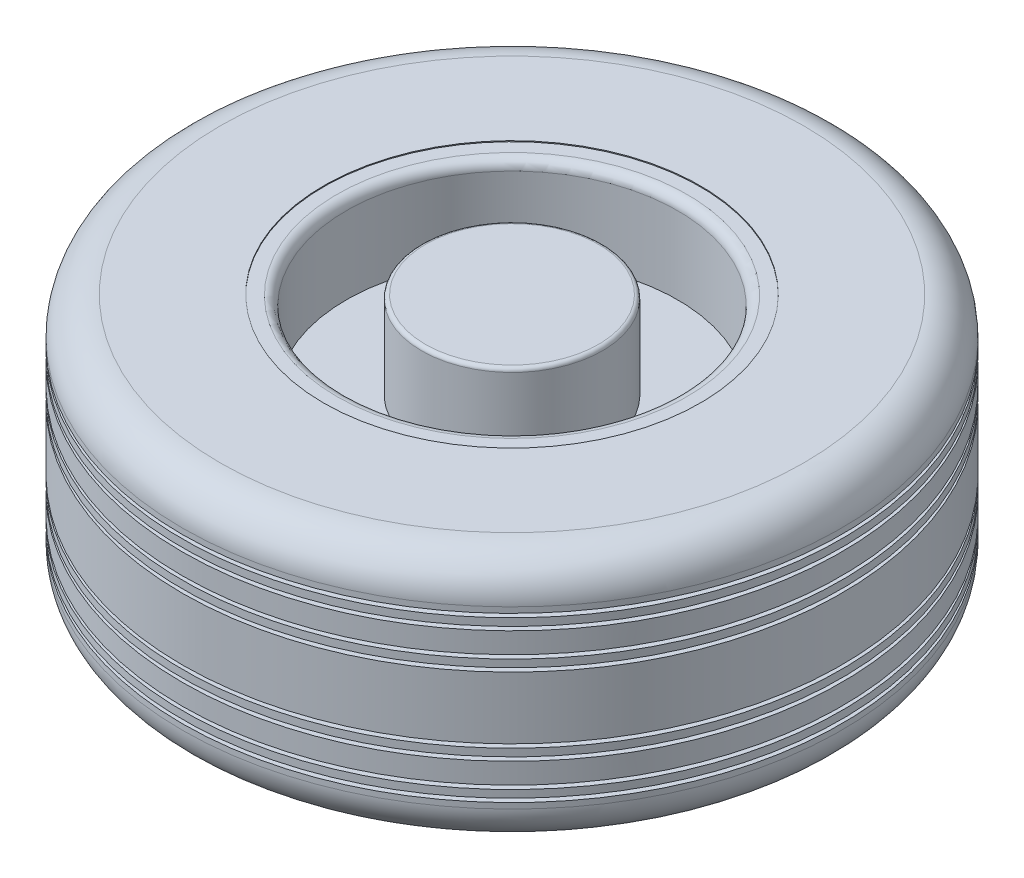
ISO-10303-21;
HEADER;
FILE_DESCRIPTION(('STEP AP214'),'2;1');
FILE_NAME('part.step','',(''),(''),'','','');
FILE_SCHEMA(('AUTOMOTIVE_DESIGN { 1 0 10303 214 1 1 1 1 }'));
ENDSEC;
DATA;
#1=APPLICATION_CONTEXT('core data for automotive mechanical design processes');
#2=APPLICATION_PROTOCOL_DEFINITION('international standard','automotive_design',2000,#1);
#3=PRODUCT_CONTEXT('',#1,'mechanical');
#4=PRODUCT('Part','Part','',(#3));
#5=PRODUCT_RELATED_PRODUCT_CATEGORY('part','',(#4));
#6=PRODUCT_DEFINITION_FORMATION('','',#4);
#7=PRODUCT_DEFINITION_CONTEXT('part definition',#1,'design');
#8=PRODUCT_DEFINITION('design','',#6,#7);
#9=PRODUCT_DEFINITION_SHAPE('','',#8);
#10=(LENGTH_UNIT() NAMED_UNIT(*) SI_UNIT(.MILLI.,.METRE.));
#11=(NAMED_UNIT(*) PLANE_ANGLE_UNIT() SI_UNIT($,.RADIAN.));
#12=(NAMED_UNIT(*) SI_UNIT($,.STERADIAN.) SOLID_ANGLE_UNIT());
#13=UNCERTAINTY_MEASURE_WITH_UNIT(LENGTH_MEASURE(1.E-05),#10,'distance_accuracy_value','');
#14=(GEOMETRIC_REPRESENTATION_CONTEXT(3) GLOBAL_UNCERTAINTY_ASSIGNED_CONTEXT((#13)) GLOBAL_UNIT_ASSIGNED_CONTEXT((#10,
#11,#12)) REPRESENTATION_CONTEXT('',''));
#15=CARTESIAN_POINT('',(0.,0.,0.));
#16=DIRECTION('',(0.,0.,1.));
#17=DIRECTION('',(1.,0.,0.));
#18=AXIS2_PLACEMENT_3D('',#15,#16,#17);
#19=CARTESIAN_POINT('',(0.,-47.6249999999999,0.));
#20=DIRECTION('',(0.,1.,0.));
#21=DIRECTION('',(0.,0.,1.));
#22=AXIS2_PLACEMENT_3D('',#19,#20,#21);
#23=PLANE('',#22);
#24=CARTESIAN_POINT('',(0.,-47.6249999999999,0.));
#25=DIRECTION('',(0.,-1.,0.));
#26=DIRECTION('',(0.,0.,-1.));
#27=AXIS2_PLACEMENT_3D('',#24,#25,#26);
#28=CIRCLE('',#27,210.82);
#29=CARTESIAN_POINT('',(0.,-47.6249999999999,-210.82));
#30=VERTEX_POINT('',#29);
#31=EDGE_CURVE('E81',#30,#30,#28,.T.);
#32=ORIENTED_EDGE('',*,*,#31,.T.);
#33=EDGE_LOOP('',(#32));
#34=FACE_BOUND('',#33,.T.);
#35=CARTESIAN_POINT('',(0.,-47.6249999999999,0.));
#36=DIRECTION('',(0.,-1.,0.));
#37=DIRECTION('',(0.,0.,-1.));
#38=AXIS2_PLACEMENT_3D('',#35,#36,#37);
#39=CIRCLE('',#38,222.25);
#40=CARTESIAN_POINT('',(0.,-47.6249999999999,-222.25));
#41=VERTEX_POINT('',#40);
#42=EDGE_CURVE('E12',#41,#41,#39,.T.);
#43=ORIENTED_EDGE('',*,*,#42,.F.);
#44=EDGE_LOOP('',(#43));
#45=FACE_BOUND('',#44,.T.);
#46=ADVANCED_FACE('F66',(#34,#45),#23,.T.);
#47=CARTESIAN_POINT('',(0.,0.,0.));
#48=DIRECTION('',(0.,-1.,0.));
#49=DIRECTION('',(0.,0.,-1.));
#50=AXIS2_PLACEMENT_3D('',#47,#48,#49);
#51=CYLINDRICAL_SURFACE('',#50,210.82);
#52=CARTESIAN_POINT('',(0.,-52.7049999999999,0.));
#53=DIRECTION('',(0.,-1.,0.));
#54=DIRECTION('',(0.,0.,-1.));
#55=AXIS2_PLACEMENT_3D('',#52,#53,#54);
#56=CIRCLE('',#55,210.82);
#57=CARTESIAN_POINT('',(0.,-52.7049999999999,-210.82));
#58=VERTEX_POINT('',#57);
#59=EDGE_CURVE('E77',#58,#58,#56,.T.);
#60=ORIENTED_EDGE('',*,*,#59,.T.);
#61=EDGE_LOOP('',(#60));
#62=FACE_BOUND('',#61,.T.);
#63=ORIENTED_EDGE('',*,*,#31,.F.);
#64=EDGE_LOOP('',(#63));
#65=FACE_BOUND('',#64,.T.);
#66=ADVANCED_FACE('F89',(#62,#65),#51,.F.);
#67=CARTESIAN_POINT('',(0.,-52.7049999999999,0.));
#68=DIRECTION('',(0.,-1.,0.));
#69=DIRECTION('',(0.,0.,-1.));
#70=AXIS2_PLACEMENT_3D('',#67,#68,#69);
#71=PLANE('',#70);
#72=CARTESIAN_POINT('',(0.,-52.7049999999999,0.));
#73=DIRECTION('',(0.,-1.,0.));
#74=DIRECTION('',(0.,0.,-1.));
#75=AXIS2_PLACEMENT_3D('',#72,#73,#74);
#76=CIRCLE('',#75,222.25);
#77=CARTESIAN_POINT('',(0.,-52.7049999999999,-222.25));
#78=VERTEX_POINT('',#77);
#79=EDGE_CURVE('E73',#78,#78,#76,.T.);
#80=ORIENTED_EDGE('',*,*,#79,.T.);
#81=EDGE_LOOP('',(#80));
#82=FACE_BOUND('',#81,.T.);
#83=ORIENTED_EDGE('',*,*,#59,.F.);
#84=EDGE_LOOP('',(#83));
#85=FACE_BOUND('',#84,.T.);
#86=ADVANCED_FACE('F91',(#82,#85),#71,.T.);
#87=CARTESIAN_POINT('',(0.,-84.455,0.));
#88=DIRECTION('',(0.,1.,0.));
#89=DIRECTION('',(0.,0.,1.));
#90=AXIS2_PLACEMENT_3D('',#87,#88,#89);
#91=CYLINDRICAL_SURFACE('',#90,222.25);
#92=ORIENTED_EDGE('',*,*,#79,.F.);
#93=EDGE_LOOP('',(#92));
#94=FACE_BOUND('',#93,.T.);
#95=ORIENTED_EDGE('',*,*,#42,.T.);
#96=EDGE_LOOP('',(#95));
#97=FACE_BOUND('',#96,.T.);
#98=ADVANCED_FACE('F68',(#94,#97),#91,.T.);
#99=CLOSED_SHELL('',(#46,#66,#86,#98));
#100=MANIFOLD_SOLID_BREP('B2',#99);
#101=CARTESIAN_POINT('',(0.,-23.4949999999999,0.));
#102=DIRECTION('',(0.,1.,0.));
#103=DIRECTION('',(0.,0.,1.));
#104=AXIS2_PLACEMENT_3D('',#101,#102,#103);
#105=PLANE('',#104);
#106=CARTESIAN_POINT('',(0.,-23.4949999999999,0.));
#107=DIRECTION('',(0.,-1.,0.));
#108=DIRECTION('',(0.,0.,-1.));
#109=AXIS2_PLACEMENT_3D('',#106,#107,#108);
#110=CIRCLE('',#109,210.82);
#111=CARTESIAN_POINT('',(0.,-23.4949999999999,-210.82));
#112=VERTEX_POINT('',#111);
#113=EDGE_CURVE('E155',#112,#112,#110,.T.);
#114=ORIENTED_EDGE('',*,*,#113,.T.);
#115=EDGE_LOOP('',(#114));
#116=FACE_BOUND('',#115,.T.);
#117=CARTESIAN_POINT('',(0.,-23.4949999999999,0.));
#118=DIRECTION('',(0.,-1.,0.));
#119=DIRECTION('',(0.,0.,-1.));
#120=AXIS2_PLACEMENT_3D('',#117,#118,#119);
#121=CIRCLE('',#120,222.25);
#122=CARTESIAN_POINT('',(0.,-23.4949999999999,-222.25));
#123=VERTEX_POINT('',#122);
#124=EDGE_CURVE('E65',#123,#123,#121,.T.);
#125=ORIENTED_EDGE('',*,*,#124,.F.);
#126=EDGE_LOOP('',(#125));
#127=FACE_BOUND('',#126,.T.);
#128=ADVANCED_FACE('F140',(#116,#127),#105,.T.);
#129=CARTESIAN_POINT('',(0.,0.,0.));
#130=DIRECTION('',(0.,-1.,0.));
#131=DIRECTION('',(0.,0.,-1.));
#132=AXIS2_PLACEMENT_3D('',#129,#130,#131);
#133=CYLINDRICAL_SURFACE('',#132,210.82);
#134=CARTESIAN_POINT('',(0.,-28.5749999999999,0.));
#135=DIRECTION('',(0.,-1.,0.));
#136=DIRECTION('',(0.,0.,-1.));
#137=AXIS2_PLACEMENT_3D('',#134,#135,#136);
#138=CIRCLE('',#137,210.82);
#139=CARTESIAN_POINT('',(0.,-28.5749999999999,-210.82));
#140=VERTEX_POINT('',#139);
#141=EDGE_CURVE('E151',#140,#140,#138,.T.);
#142=ORIENTED_EDGE('',*,*,#141,.T.);
#143=EDGE_LOOP('',(#142));
#144=FACE_BOUND('',#143,.T.);
#145=ORIENTED_EDGE('',*,*,#113,.F.);
#146=EDGE_LOOP('',(#145));
#147=FACE_BOUND('',#146,.T.);
#148=ADVANCED_FACE('F163',(#144,#147),#133,.F.);
#149=CARTESIAN_POINT('',(0.,-28.5749999999999,0.));
#150=DIRECTION('',(0.,-1.,0.));
#151=DIRECTION('',(0.,0.,-1.));
#152=AXIS2_PLACEMENT_3D('',#149,#150,#151);
#153=PLANE('',#152);
#154=CARTESIAN_POINT('',(0.,-28.5749999999999,0.));
#155=DIRECTION('',(0.,-1.,0.));
#156=DIRECTION('',(0.,0.,-1.));
#157=AXIS2_PLACEMENT_3D('',#154,#155,#156);
#158=CIRCLE('',#157,222.25);
#159=CARTESIAN_POINT('',(0.,-28.5749999999999,-222.25));
#160=VERTEX_POINT('',#159);
#161=EDGE_CURVE('E147',#160,#160,#158,.T.);
#162=ORIENTED_EDGE('',*,*,#161,.T.);
#163=EDGE_LOOP('',(#162));
#164=FACE_BOUND('',#163,.T.);
#165=ORIENTED_EDGE('',*,*,#141,.F.);
#166=EDGE_LOOP('',(#165));
#167=FACE_BOUND('',#166,.T.);
#168=ADVANCED_FACE('F165',(#164,#167),#153,.T.);
#169=CARTESIAN_POINT('',(0.,-84.455,0.));
#170=DIRECTION('',(0.,1.,0.));
#171=DIRECTION('',(0.,0.,1.));
#172=AXIS2_PLACEMENT_3D('',#169,#170,#171);
#173=CYLINDRICAL_SURFACE('',#172,222.25);
#174=ORIENTED_EDGE('',*,*,#161,.F.);
#175=EDGE_LOOP('',(#174));
#176=FACE_BOUND('',#175,.T.);
#177=ORIENTED_EDGE('',*,*,#124,.T.);
#178=EDGE_LOOP('',(#177));
#179=FACE_BOUND('',#178,.T.);
#180=ADVANCED_FACE('F142',(#176,#179),#173,.T.);
#181=CLOSED_SHELL('',(#128,#148,#168,#180));
#182=MANIFOLD_SOLID_BREP('B7',#181);
#183=CARTESIAN_POINT('',(0.,23.4949999999999,0.));
#184=DIRECTION('',(0.,1.,0.));
#185=DIRECTION('',(0.,0.,1.));
#186=AXIS2_PLACEMENT_3D('',#183,#184,#185);
#187=PLANE('',#186);
#188=CARTESIAN_POINT('',(0.,23.4949999999999,0.));
#189=DIRECTION('',(0.,-1.,0.));
#190=DIRECTION('',(0.,0.,-1.));
#191=AXIS2_PLACEMENT_3D('',#188,#189,#190);
#192=CIRCLE('',#191,210.82);
#193=CARTESIAN_POINT('',(0.,23.4949999999999,-210.82));
#194=VERTEX_POINT('',#193);
#195=EDGE_CURVE('E225',#194,#194,#192,.T.);
#196=ORIENTED_EDGE('',*,*,#195,.F.);
#197=EDGE_LOOP('',(#196));
#198=FACE_BOUND('',#197,.T.);
#199=CARTESIAN_POINT('',(0.,23.4949999999999,0.));
#200=DIRECTION('',(0.,-1.,0.));
#201=DIRECTION('',(0.,0.,-1.));
#202=AXIS2_PLACEMENT_3D('',#199,#200,#201);
#203=CIRCLE('',#202,222.25);
#204=CARTESIAN_POINT('',(0.,23.4949999999999,-222.25));
#205=VERTEX_POINT('',#204);
#206=EDGE_CURVE('E229',#205,#205,#203,.T.);
#207=ORIENTED_EDGE('',*,*,#206,.T.);
#208=EDGE_LOOP('',(#207));
#209=FACE_BOUND('',#208,.T.);
#210=ADVANCED_FACE('F214',(#198,#209),#187,.F.);
#211=CARTESIAN_POINT('',(0.,0.,0.));
#212=DIRECTION('',(0.,-1.,0.));
#213=DIRECTION('',(0.,0.,-1.));
#214=AXIS2_PLACEMENT_3D('',#211,#212,#213);
#215=CYLINDRICAL_SURFACE('',#214,210.82);
#216=CARTESIAN_POINT('',(0.,28.5749999999999,0.));
#217=DIRECTION('',(0.,-1.,0.));
#218=DIRECTION('',(0.,0.,-1.));
#219=AXIS2_PLACEMENT_3D('',#216,#217,#218);
#220=CIRCLE('',#219,210.82);
#221=CARTESIAN_POINT('',(0.,28.5749999999999,-210.82));
#222=VERTEX_POINT('',#221);
#223=EDGE_CURVE('E221',#222,#222,#220,.T.);
#224=ORIENTED_EDGE('',*,*,#223,.F.);
#225=EDGE_LOOP('',(#224));
#226=FACE_BOUND('',#225,.T.);
#227=ORIENTED_EDGE('',*,*,#195,.T.);
#228=EDGE_LOOP('',(#227));
#229=FACE_BOUND('',#228,.T.);
#230=ADVANCED_FACE('F241',(#226,#229),#215,.F.);
#231=CARTESIAN_POINT('',(0.,28.5749999999999,0.));
#232=DIRECTION('',(0.,-1.,0.));
#233=DIRECTION('',(0.,0.,-1.));
#234=AXIS2_PLACEMENT_3D('',#231,#232,#233);
#235=PLANE('',#234);
#236=CARTESIAN_POINT('',(0.,28.5749999999999,0.));
#237=DIRECTION('',(0.,-1.,0.));
#238=DIRECTION('',(0.,0.,-1.));
#239=AXIS2_PLACEMENT_3D('',#236,#237,#238);
#240=CIRCLE('',#239,222.25);
#241=CARTESIAN_POINT('',(0.,28.5749999999999,-222.25));
#242=VERTEX_POINT('',#241);
#243=EDGE_CURVE('E139',#242,#242,#240,.T.);
#244=ORIENTED_EDGE('',*,*,#243,.F.);
#245=EDGE_LOOP('',(#244));
#246=FACE_BOUND('',#245,.T.);
#247=ORIENTED_EDGE('',*,*,#223,.T.);
#248=EDGE_LOOP('',(#247));
#249=FACE_BOUND('',#248,.T.);
#250=ADVANCED_FACE('F237',(#246,#249),#235,.F.);
#251=CARTESIAN_POINT('',(0.,-84.455,0.));
#252=DIRECTION('',(0.,1.,0.));
#253=DIRECTION('',(0.,0.,1.));
#254=AXIS2_PLACEMENT_3D('',#251,#252,#253);
#255=CYLINDRICAL_SURFACE('',#254,222.25);
#256=ORIENTED_EDGE('',*,*,#206,.F.);
#257=EDGE_LOOP('',(#256));
#258=FACE_BOUND('',#257,.T.);
#259=ORIENTED_EDGE('',*,*,#243,.T.);
#260=EDGE_LOOP('',(#259));
#261=FACE_BOUND('',#260,.T.);
#262=ADVANCED_FACE('F216',(#258,#261),#255,.T.);
#263=CLOSED_SHELL('',(#210,#230,#250,#262));
#264=MANIFOLD_SOLID_BREP('B60',#263);
#265=CARTESIAN_POINT('',(0.,52.7049999999999,0.));
#266=DIRECTION('',(0.,-1.,0.));
#267=DIRECTION('',(0.,0.,-1.));
#268=AXIS2_PLACEMENT_3D('',#265,#266,#267);
#269=PLANE('',#268);
#270=CARTESIAN_POINT('',(0.,52.7049999999999,0.));
#271=DIRECTION('',(0.,-1.,0.));
#272=DIRECTION('',(0.,0.,-1.));
#273=AXIS2_PLACEMENT_3D('',#270,#271,#272);
#274=CIRCLE('',#273,222.25);
#275=CARTESIAN_POINT('',(0.,52.7049999999999,-222.25));
#276=VERTEX_POINT('',#275);
#277=EDGE_CURVE('E213',#276,#276,#274,.T.);
#278=ORIENTED_EDGE('',*,*,#277,.F.);
#279=EDGE_LOOP('',(#278));
#280=FACE_BOUND('',#279,.T.);
#281=CARTESIAN_POINT('',(0.,52.7049999999999,0.));
#282=DIRECTION('',(0.,-1.,0.));
#283=DIRECTION('',(0.,0.,-1.));
#284=AXIS2_PLACEMENT_3D('',#281,#282,#283);
#285=CIRCLE('',#284,210.82);
#286=CARTESIAN_POINT('',(0.,52.7049999999999,-210.82));
#287=VERTEX_POINT('',#286);
#288=EDGE_CURVE('E291',#287,#287,#285,.T.);
#289=ORIENTED_EDGE('',*,*,#288,.T.);
#290=EDGE_LOOP('',(#289));
#291=FACE_BOUND('',#290,.T.);
#292=ADVANCED_FACE('F287',(#280,#291),#269,.F.);
#293=CARTESIAN_POINT('',(0.,47.6249999999999,0.));
#294=DIRECTION('',(0.,1.,0.));
#295=DIRECTION('',(0.,0.,1.));
#296=AXIS2_PLACEMENT_3D('',#293,#294,#295);
#297=PLANE('',#296);
#298=CARTESIAN_POINT('',(0.,47.6249999999999,0.));
#299=DIRECTION('',(0.,-1.,0.));
#300=DIRECTION('',(0.,0.,-1.));
#301=AXIS2_PLACEMENT_3D('',#298,#299,#300);
#302=CIRCLE('',#301,210.82);
#303=CARTESIAN_POINT('',(0.,47.6249999999999,-210.82));
#304=VERTEX_POINT('',#303);
#305=EDGE_CURVE('E295',#304,#304,#302,.T.);
#306=ORIENTED_EDGE('',*,*,#305,.F.);
#307=EDGE_LOOP('',(#306));
#308=FACE_BOUND('',#307,.T.);
#309=CARTESIAN_POINT('',(0.,47.6249999999999,0.));
#310=DIRECTION('',(0.,-1.,0.));
#311=DIRECTION('',(0.,0.,-1.));
#312=AXIS2_PLACEMENT_3D('',#309,#310,#311);
#313=CIRCLE('',#312,222.25);
#314=CARTESIAN_POINT('',(0.,47.6249999999999,-222.25));
#315=VERTEX_POINT('',#314);
#316=EDGE_CURVE('E300',#315,#315,#313,.T.);
#317=ORIENTED_EDGE('',*,*,#316,.T.);
#318=EDGE_LOOP('',(#317));
#319=FACE_BOUND('',#318,.T.);
#320=ADVANCED_FACE('F312',(#308,#319),#297,.F.);
#321=CARTESIAN_POINT('',(0.,0.,0.));
#322=DIRECTION('',(0.,-1.,0.));
#323=DIRECTION('',(0.,0.,-1.));
#324=AXIS2_PLACEMENT_3D('',#321,#322,#323);
#325=CYLINDRICAL_SURFACE('',#324,210.82);
#326=ORIENTED_EDGE('',*,*,#288,.F.);
#327=EDGE_LOOP('',(#326));
#328=FACE_BOUND('',#327,.T.);
#329=ORIENTED_EDGE('',*,*,#305,.T.);
#330=EDGE_LOOP('',(#329));
#331=FACE_BOUND('',#330,.T.);
#332=ADVANCED_FACE('F309',(#328,#331),#325,.F.);
#333=CARTESIAN_POINT('',(0.,-84.455,0.));
#334=DIRECTION('',(0.,1.,0.));
#335=DIRECTION('',(0.,0.,1.));
#336=AXIS2_PLACEMENT_3D('',#333,#334,#335);
#337=CYLINDRICAL_SURFACE('',#336,222.25);
#338=ORIENTED_EDGE('',*,*,#277,.T.);
#339=EDGE_LOOP('',(#338));
#340=FACE_BOUND('',#339,.T.);
#341=ORIENTED_EDGE('',*,*,#316,.F.);
#342=EDGE_LOOP('',(#341));
#343=FACE_BOUND('',#342,.T.);
#344=ADVANCED_FACE('F289',(#340,#343),#337,.T.);
#345=CLOSED_SHELL('',(#292,#320,#332,#344));
#346=MANIFOLD_SOLID_BREP('B134',#345);
#347=CARTESIAN_POINT('',(0.,-83.82,0.));
#348=DIRECTION('',(0.,1.,0.));
#349=DIRECTION('',(0.,0.,1.));
#350=AXIS2_PLACEMENT_3D('',#347,#348,#349);
#351=CYLINDRICAL_SURFACE('',#350,111.76);
#352=CARTESIAN_POINT('',(0.,-77.47,0.));
#353=DIRECTION('',(0.,1.,0.));
#354=DIRECTION('',(0.,0.,1.));
#355=AXIS2_PLACEMENT_3D('',#352,#353,#354);
#356=CIRCLE('',#355,111.76);
#357=CARTESIAN_POINT('',(0.,-77.47,111.76));
#358=VERTEX_POINT('',#357);
#359=EDGE_CURVE('E385',#358,#358,#356,.F.);
#360=ORIENTED_EDGE('',*,*,#359,.T.);
#361=EDGE_LOOP('',(#360));
#362=FACE_BOUND('',#361,.T.);
#363=CARTESIAN_POINT('',(0.,-25.4,0.));
#364=DIRECTION('',(0.,1.,0.));
#365=DIRECTION('',(0.,0.,1.));
#366=AXIS2_PLACEMENT_3D('',#363,#364,#365);
#367=CIRCLE('',#366,111.76);
#368=CARTESIAN_POINT('',(0.,-25.4,111.76));
#369=VERTEX_POINT('',#368);
#370=EDGE_CURVE('E391',#369,#369,#367,.F.);
#371=ORIENTED_EDGE('',*,*,#370,.F.);
#372=EDGE_LOOP('',(#371));
#373=FACE_BOUND('',#372,.T.);
#374=ADVANCED_FACE('F353',(#362,#373),#351,.F.);
#375=CARTESIAN_POINT('',(0.,-84.455,0.));
#376=DIRECTION('',(0.,1.,0.));
#377=DIRECTION('',(0.,0.,1.));
#378=AXIS2_PLACEMENT_3D('',#375,#376,#377);
#379=CYLINDRICAL_SURFACE('',#378,127.);
#380=CARTESIAN_POINT('',(0.,-84.455,0.));
#381=DIRECTION('',(0.,1.,0.));
#382=DIRECTION('',(0.,0.,1.));
#383=AXIS2_PLACEMENT_3D('',#380,#381,#382);
#384=CIRCLE('',#383,127.);
#385=CARTESIAN_POINT('',(0.,-84.455,127.));
#386=VERTEX_POINT('',#385);
#387=EDGE_CURVE('E409',#386,#386,#384,.T.);
#388=ORIENTED_EDGE('',*,*,#387,.F.);
#389=EDGE_LOOP('',(#388));
#390=FACE_BOUND('',#389,.T.);
#391=CARTESIAN_POINT('',(0.,-83.82,0.));
#392=DIRECTION('',(0.,1.,0.));
#393=DIRECTION('',(0.,0.,1.));
#394=AXIS2_PLACEMENT_3D('',#391,#392,#393);
#395=CIRCLE('',#394,127.);
#396=CARTESIAN_POINT('',(0.,-83.82,127.));
#397=VERTEX_POINT('',#396);
#398=EDGE_CURVE('E394',#397,#397,#395,.F.);
#399=ORIENTED_EDGE('',*,*,#398,.F.);
#400=EDGE_LOOP('',(#399));
#401=FACE_BOUND('',#400,.T.);
#402=ADVANCED_FACE('F494',(#390,#401),#379,.F.);
#403=CARTESIAN_POINT('',(0.,-84.455,0.));
#404=DIRECTION('',(0.,1.,0.));
#405=DIRECTION('',(0.,0.,1.));
#406=AXIS2_PLACEMENT_3D('',#403,#404,#405);
#407=CYLINDRICAL_SURFACE('',#406,222.25);
#408=CARTESIAN_POINT('',(0.,59.055,0.));
#409=DIRECTION('',(0.,1.,0.));
#410=DIRECTION('',(0.,0.,1.));
#411=AXIS2_PLACEMENT_3D('',#408,#409,#410);
#412=CIRCLE('',#411,222.25);
#413=CARTESIAN_POINT('',(0.,59.055,222.25));
#414=VERTEX_POINT('',#413);
#415=EDGE_CURVE('E403',#414,#414,#412,.F.);
#416=ORIENTED_EDGE('',*,*,#415,.T.);
#417=EDGE_LOOP('',(#416));
#418=FACE_BOUND('',#417,.T.);
#419=CARTESIAN_POINT('',(0.,55.2449999999999,0.));
#420=DIRECTION('',(0.,-1.,0.));
#421=DIRECTION('',(0.,0.,-1.));
#422=AXIS2_PLACEMENT_3D('',#419,#420,#421);
#423=CIRCLE('',#422,222.25);
#424=CARTESIAN_POINT('',(0.,55.2449999999999,-222.25));
#425=VERTEX_POINT('',#424);
#426=EDGE_CURVE('E410',#425,#425,#423,.F.);
#427=ORIENTED_EDGE('',*,*,#426,.T.);
#428=EDGE_LOOP('',(#427));
#429=FACE_BOUND('',#428,.T.);
#430=ADVANCED_FACE('F501',(#418,#429),#407,.T.);
#431=CARTESIAN_POINT('',(0.,-59.055,0.));
#432=DIRECTION('',(0.,1.,0.));
#433=DIRECTION('',(0.,0.,1.));
#434=AXIS2_PLACEMENT_3D('',#431,#432,#433);
#435=CIRCLE('',#434,222.25);
#436=CARTESIAN_POINT('',(0.,-59.055,222.25));
#437=VERTEX_POINT('',#436);
#438=EDGE_CURVE('E400',#437,#437,#435,.T.);
#439=ORIENTED_EDGE('',*,*,#438,.T.);
#440=EDGE_LOOP('',(#439));
#441=FACE_BOUND('',#440,.T.);
#442=CARTESIAN_POINT('',(0.,-55.2449999999999,0.));
#443=DIRECTION('',(0.,-1.,0.));
#444=DIRECTION('',(0.,0.,-1.));
#445=AXIS2_PLACEMENT_3D('',#442,#443,#444);
#446=CIRCLE('',#445,222.25);
#447=CARTESIAN_POINT('',(0.,-55.2449999999999,-222.25));
#448=VERTEX_POINT('',#447);
#449=EDGE_CURVE('E432',#448,#448,#446,.F.);
#450=ORIENTED_EDGE('',*,*,#449,.F.);
#451=EDGE_LOOP('',(#450));
#452=FACE_BOUND('',#451,.T.);
#453=ADVANCED_FACE('F579',(#441,#452),#407,.T.);
#454=CARTESIAN_POINT('',(0.,-84.455,0.));
#455=DIRECTION('',(0.,1.,0.));
#456=DIRECTION('',(0.,0.,1.));
#457=AXIS2_PLACEMENT_3D('',#454,#455,#456);
#458=PLANE('',#457);
#459=CARTESIAN_POINT('',(0.,-84.455,0.));
#460=DIRECTION('',(0.,1.,0.));
#461=DIRECTION('',(0.,0.,1.));
#462=AXIS2_PLACEMENT_3D('',#459,#460,#461);
#463=CIRCLE('',#462,196.85);
#464=CARTESIAN_POINT('',(0.,-84.455,196.85));
#465=VERTEX_POINT('',#464);
#466=EDGE_CURVE('E397',#465,#465,#463,.F.);
#467=ORIENTED_EDGE('',*,*,#466,.T.);
#468=EDGE_LOOP('',(#467));
#469=FACE_BOUND('',#468,.T.);
#470=ORIENTED_EDGE('',*,*,#387,.T.);
#471=EDGE_LOOP('',(#470));
#472=FACE_BOUND('',#471,.T.);
#473=ADVANCED_FACE('F561',(#469,#472),#458,.F.);
#474=CARTESIAN_POINT('',(0.,83.82,0.));
#475=DIRECTION('',(0.,1.,0.));
#476=DIRECTION('',(0.,0.,1.));
#477=AXIS2_PLACEMENT_3D('',#474,#475,#476);
#478=CIRCLE('',#477,127.);
#479=CARTESIAN_POINT('',(0.,83.82,127.));
#480=VERTEX_POINT('',#479);
#481=EDGE_CURVE('E447',#480,#480,#478,.T.);
#482=ORIENTED_EDGE('',*,*,#481,.F.);
#483=EDGE_LOOP('',(#482));
#484=FACE_BOUND('',#483,.T.);
#485=CARTESIAN_POINT('',(0.,84.455,0.));
#486=DIRECTION('',(0.,1.,0.));
#487=DIRECTION('',(0.,0.,1.));
#488=AXIS2_PLACEMENT_3D('',#485,#486,#487);
#489=CIRCLE('',#488,127.);
#490=CARTESIAN_POINT('',(0.,84.455,127.));
#491=VERTEX_POINT('',#490);
#492=EDGE_CURVE('E413',#491,#491,#489,.T.);
#493=ORIENTED_EDGE('',*,*,#492,.T.);
#494=EDGE_LOOP('',(#493));
#495=FACE_BOUND('',#494,.T.);
#496=ADVANCED_FACE('F504',(#484,#495),#379,.F.);
#497=CARTESIAN_POINT('',(0.,84.455,0.));
#498=DIRECTION('',(0.,1.,0.));
#499=DIRECTION('',(0.,0.,1.));
#500=AXIS2_PLACEMENT_3D('',#497,#498,#499);
#501=PLANE('',#500);
#502=CARTESIAN_POINT('',(0.,84.455,0.));
#503=DIRECTION('',(0.,1.,0.));
#504=DIRECTION('',(0.,0.,1.));
#505=AXIS2_PLACEMENT_3D('',#502,#503,#504);
#506=CIRCLE('',#505,196.85);
#507=CARTESIAN_POINT('',(0.,84.455,196.85));
#508=VERTEX_POINT('',#507);
#509=EDGE_CURVE('E406',#508,#508,#506,.T.);
#510=ORIENTED_EDGE('',*,*,#509,.T.);
#511=EDGE_LOOP('',(#510));
#512=FACE_BOUND('',#511,.T.);
#513=ORIENTED_EDGE('',*,*,#492,.F.);
#514=EDGE_LOOP('',(#513));
#515=FACE_BOUND('',#514,.T.);
#516=ADVANCED_FACE('F560',(#512,#515),#501,.T.);
#517=CARTESIAN_POINT('',(0.,-45.0849999999999,0.));
#518=DIRECTION('',(0.,1.,0.));
#519=DIRECTION('',(0.,0.,1.));
#520=AXIS2_PLACEMENT_3D('',#517,#518,#519);
#521=PLANE('',#520);
#522=CARTESIAN_POINT('',(0.,-45.0849999999999,0.));
#523=DIRECTION('',(0.,1.,0.));
#524=DIRECTION('',(0.,0.,1.));
#525=AXIS2_PLACEMENT_3D('',#522,#523,#524);
#526=CIRCLE('',#525,222.25);
#527=CARTESIAN_POINT('',(0.,-45.0849999999999,222.25));
#528=VERTEX_POINT('',#527);
#529=EDGE_CURVE('E429',#528,#528,#526,.F.);
#530=ORIENTED_EDGE('',*,*,#529,.T.);
#531=EDGE_LOOP('',(#530));
#532=FACE_BOUND('',#531,.T.);
#533=CARTESIAN_POINT('',(0.,-45.0849999999999,0.));
#534=DIRECTION('',(0.,-1.,0.));
#535=DIRECTION('',(0.,0.,-1.));
#536=AXIS2_PLACEMENT_3D('',#533,#534,#535);
#537=CIRCLE('',#536,208.28);
#538=CARTESIAN_POINT('',(0.,-45.0849999999999,-208.28));
#539=VERTEX_POINT('',#538);
#540=EDGE_CURVE('E440',#539,#539,#537,.T.);
#541=ORIENTED_EDGE('',*,*,#540,.F.);
#542=EDGE_LOOP('',(#541));
#543=FACE_BOUND('',#542,.T.);
#544=ADVANCED_FACE('F565',(#532,#543),#521,.F.);
#545=CARTESIAN_POINT('',(0.,0.,0.));
#546=DIRECTION('',(0.,-1.,0.));
#547=DIRECTION('',(0.,0.,-1.));
#548=AXIS2_PLACEMENT_3D('',#545,#546,#547);
#549=CYLINDRICAL_SURFACE('',#548,208.28);
#550=CARTESIAN_POINT('',(0.,-55.2449999999999,0.));
#551=DIRECTION('',(0.,-1.,0.));
#552=DIRECTION('',(0.,0.,-1.));
#553=AXIS2_PLACEMENT_3D('',#550,#551,#552);
#554=CIRCLE('',#553,208.28);
#555=CARTESIAN_POINT('',(0.,-55.2449999999999,-208.28));
#556=VERTEX_POINT('',#555);
#557=EDGE_CURVE('E444',#556,#556,#554,.T.);
#558=ORIENTED_EDGE('',*,*,#557,.F.);
#559=EDGE_LOOP('',(#558));
#560=FACE_BOUND('',#559,.T.);
#561=ORIENTED_EDGE('',*,*,#540,.T.);
#562=EDGE_LOOP('',(#561));
#563=FACE_BOUND('',#562,.T.);
#564=ADVANCED_FACE('F572',(#560,#563),#549,.T.);
#565=CARTESIAN_POINT('',(0.,-55.2449999999999,0.));
#566=DIRECTION('',(0.,-1.,0.));
#567=DIRECTION('',(0.,0.,-1.));
#568=AXIS2_PLACEMENT_3D('',#565,#566,#567);
#569=PLANE('',#568);
#570=ORIENTED_EDGE('',*,*,#449,.T.);
#571=EDGE_LOOP('',(#570));
#572=FACE_BOUND('',#571,.T.);
#573=ORIENTED_EDGE('',*,*,#557,.T.);
#574=EDGE_LOOP('',(#573));
#575=FACE_BOUND('',#574,.T.);
#576=ADVANCED_FACE('F877',(#572,#575),#569,.F.);
#577=CARTESIAN_POINT('',(0.,-31.1149999999999,0.));
#578=DIRECTION('',(0.,-1.,0.));
#579=DIRECTION('',(0.,0.,-1.));
#580=AXIS2_PLACEMENT_3D('',#577,#578,#579);
#581=CIRCLE('',#580,222.25);
#582=CARTESIAN_POINT('',(0.,-31.1149999999999,-222.25));
#583=VERTEX_POINT('',#582);
#584=EDGE_CURVE('E426',#583,#583,#581,.F.);
#585=ORIENTED_EDGE('',*,*,#584,.F.);
#586=EDGE_LOOP('',(#585));
#587=FACE_BOUND('',#586,.T.);
#588=ORIENTED_EDGE('',*,*,#529,.F.);
#589=EDGE_LOOP('',(#588));
#590=FACE_BOUND('',#589,.T.);
#591=ADVANCED_FACE('F584',(#587,#590),#407,.T.);
#592=CARTESIAN_POINT('',(0.,-20.9549999999999,0.));
#593=DIRECTION('',(0.,1.,0.));
#594=DIRECTION('',(0.,0.,1.));
#595=AXIS2_PLACEMENT_3D('',#592,#593,#594);
#596=PLANE('',#595);
#597=CARTESIAN_POINT('',(0.,-20.9549999999999,0.));
#598=DIRECTION('',(0.,1.,0.));
#599=DIRECTION('',(0.,0.,1.));
#600=AXIS2_PLACEMENT_3D('',#597,#598,#599);
#601=CIRCLE('',#600,222.25);
#602=CARTESIAN_POINT('',(0.,-20.9549999999999,222.25));
#603=VERTEX_POINT('',#602);
#604=EDGE_CURVE('E423',#603,#603,#601,.F.);
#605=ORIENTED_EDGE('',*,*,#604,.T.);
#606=EDGE_LOOP('',(#605));
#607=FACE_BOUND('',#606,.T.);
#608=CARTESIAN_POINT('',(0.,-20.9549999999999,0.));
#609=DIRECTION('',(0.,-1.,0.));
#610=DIRECTION('',(0.,0.,-1.));
#611=AXIS2_PLACEMENT_3D('',#608,#609,#610);
#612=CIRCLE('',#611,208.28);
#613=CARTESIAN_POINT('',(0.,-20.9549999999999,-208.28));
#614=VERTEX_POINT('',#613);
#615=EDGE_CURVE('E448',#614,#614,#612,.T.);
#616=ORIENTED_EDGE('',*,*,#615,.F.);
#617=EDGE_LOOP('',(#616));
#618=FACE_BOUND('',#617,.T.);
#619=ADVANCED_FACE('F861',(#607,#618),#596,.F.);
#620=CARTESIAN_POINT('',(0.,0.,0.));
#621=DIRECTION('',(0.,-1.,0.));
#622=DIRECTION('',(0.,0.,-1.));
#623=AXIS2_PLACEMENT_3D('',#620,#621,#622);
#624=CYLINDRICAL_SURFACE('',#623,208.28);
#625=CARTESIAN_POINT('',(0.,-31.1149999999999,0.));
#626=DIRECTION('',(0.,-1.,0.));
#627=DIRECTION('',(0.,0.,-1.));
#628=AXIS2_PLACEMENT_3D('',#625,#626,#627);
#629=CIRCLE('',#628,208.28);
#630=CARTESIAN_POINT('',(0.,-31.1149999999999,-208.28));
#631=VERTEX_POINT('',#630);
#632=EDGE_CURVE('E443',#631,#631,#629,.T.);
#633=ORIENTED_EDGE('',*,*,#632,.F.);
#634=EDGE_LOOP('',(#633));
#635=FACE_BOUND('',#634,.T.);
#636=ORIENTED_EDGE('',*,*,#615,.T.);
#637=EDGE_LOOP('',(#636));
#638=FACE_BOUND('',#637,.T.);
#639=ADVANCED_FACE('F851',(#635,#638),#624,.T.);
#640=CARTESIAN_POINT('',(0.,-31.1149999999999,0.));
#641=DIRECTION('',(0.,-1.,0.));
#642=DIRECTION('',(0.,0.,-1.));
#643=AXIS2_PLACEMENT_3D('',#640,#641,#642);
#644=PLANE('',#643);
#645=ORIENTED_EDGE('',*,*,#584,.T.);
#646=EDGE_LOOP('',(#645));
#647=FACE_BOUND('',#646,.T.);
#648=ORIENTED_EDGE('',*,*,#632,.T.);
#649=EDGE_LOOP('',(#648));
#650=FACE_BOUND('',#649,.T.);
#651=ADVANCED_FACE('F846',(#647,#650),#644,.F.);
#652=ORIENTED_EDGE('',*,*,#604,.F.);
#653=EDGE_LOOP('',(#652));
#654=FACE_BOUND('',#653,.T.);
#655=CARTESIAN_POINT('',(0.,20.9549999999999,0.));
#656=DIRECTION('',(0.,1.,0.));
#657=DIRECTION('',(0.,0.,1.));
#658=AXIS2_PLACEMENT_3D('',#655,#656,#657);
#659=CIRCLE('',#658,222.25);
#660=CARTESIAN_POINT('',(0.,20.9549999999999,222.25));
#661=VERTEX_POINT('',#660);
#662=EDGE_CURVE('E417',#661,#661,#659,.F.);
#663=ORIENTED_EDGE('',*,*,#662,.T.);
#664=EDGE_LOOP('',(#663));
#665=FACE_BOUND('',#664,.T.);
#666=ADVANCED_FACE('F839',(#654,#665),#407,.T.);
#667=CARTESIAN_POINT('',(0.,20.9549999999999,0.));
#668=DIRECTION('',(0.,1.,0.));
#669=DIRECTION('',(0.,0.,1.));
#670=AXIS2_PLACEMENT_3D('',#667,#668,#669);
#671=PLANE('',#670);
#672=ORIENTED_EDGE('',*,*,#662,.F.);
#673=EDGE_LOOP('',(#672));
#674=FACE_BOUND('',#673,.T.);
#675=CARTESIAN_POINT('',(0.,20.9549999999999,0.));
#676=DIRECTION('',(0.,-1.,0.));
#677=DIRECTION('',(0.,0.,-1.));
#678=AXIS2_PLACEMENT_3D('',#675,#676,#677);
#679=CIRCLE('',#678,208.28);
#680=CARTESIAN_POINT('',(0.,20.9549999999999,-208.28));
#681=VERTEX_POINT('',#680);
#682=EDGE_CURVE('E454',#681,#681,#679,.T.);
#683=ORIENTED_EDGE('',*,*,#682,.T.);
#684=EDGE_LOOP('',(#683));
#685=FACE_BOUND('',#684,.T.);
#686=ADVANCED_FACE('F829',(#674,#685),#671,.T.);
#687=CARTESIAN_POINT('',(0.,0.,0.));
#688=DIRECTION('',(0.,-1.,0.));
#689=DIRECTION('',(0.,0.,-1.));
#690=AXIS2_PLACEMENT_3D('',#687,#688,#689);
#691=CYLINDRICAL_SURFACE('',#690,208.28);
#692=CARTESIAN_POINT('',(0.,31.1149999999999,0.));
#693=DIRECTION('',(0.,-1.,0.));
#694=DIRECTION('',(0.,0.,-1.));
#695=AXIS2_PLACEMENT_3D('',#692,#693,#694);
#696=CIRCLE('',#695,208.28);
#697=CARTESIAN_POINT('',(0.,31.1149999999999,-208.28));
#698=VERTEX_POINT('',#697);
#699=EDGE_CURVE('E451',#698,#698,#696,.T.);
#700=ORIENTED_EDGE('',*,*,#699,.T.);
#701=EDGE_LOOP('',(#700));
#702=FACE_BOUND('',#701,.T.);
#703=ORIENTED_EDGE('',*,*,#682,.F.);
#704=EDGE_LOOP('',(#703));
#705=FACE_BOUND('',#704,.T.);
#706=ADVANCED_FACE('F819',(#702,#705),#691,.T.);
#707=CARTESIAN_POINT('',(0.,31.1149999999999,0.));
#708=DIRECTION('',(0.,-1.,0.));
#709=DIRECTION('',(0.,0.,-1.));
#710=AXIS2_PLACEMENT_3D('',#707,#708,#709);
#711=PLANE('',#710);
#712=CARTESIAN_POINT('',(0.,31.1149999999999,0.));
#713=DIRECTION('',(0.,-1.,0.));
#714=DIRECTION('',(0.,0.,-1.));
#715=AXIS2_PLACEMENT_3D('',#712,#713,#714);
#716=CIRCLE('',#715,222.25);
#717=CARTESIAN_POINT('',(0.,31.1149999999999,-222.25));
#718=VERTEX_POINT('',#717);
#719=EDGE_CURVE('E420',#718,#718,#716,.F.);
#720=ORIENTED_EDGE('',*,*,#719,.F.);
#721=EDGE_LOOP('',(#720));
#722=FACE_BOUND('',#721,.T.);
#723=ORIENTED_EDGE('',*,*,#699,.F.);
#724=EDGE_LOOP('',(#723));
#725=FACE_BOUND('',#724,.T.);
#726=ADVANCED_FACE('F809',(#722,#725),#711,.T.);
#727=CARTESIAN_POINT('',(0.,55.2449999999999,0.));
#728=DIRECTION('',(0.,-1.,0.));
#729=DIRECTION('',(0.,0.,-1.));
#730=AXIS2_PLACEMENT_3D('',#727,#728,#729);
#731=PLANE('',#730);
#732=ORIENTED_EDGE('',*,*,#426,.F.);
#733=EDGE_LOOP('',(#732));
#734=FACE_BOUND('',#733,.T.);
#735=CARTESIAN_POINT('',(0.,55.2449999999999,0.));
#736=DIRECTION('',(0.,-1.,0.));
#737=DIRECTION('',(0.,0.,-1.));
#738=AXIS2_PLACEMENT_3D('',#735,#736,#737);
#739=CIRCLE('',#738,208.28);
#740=CARTESIAN_POINT('',(0.,55.2449999999999,-208.28));
#741=VERTEX_POINT('',#740);
#742=EDGE_CURVE('E457',#741,#741,#739,.T.);
#743=ORIENTED_EDGE('',*,*,#742,.F.);
#744=EDGE_LOOP('',(#743));
#745=FACE_BOUND('',#744,.T.);
#746=ADVANCED_FACE('F799',(#734,#745),#731,.T.);
#747=CARTESIAN_POINT('',(0.,45.0849999999999,0.));
#748=DIRECTION('',(0.,1.,0.));
#749=DIRECTION('',(0.,0.,1.));
#750=AXIS2_PLACEMENT_3D('',#747,#748,#749);
#751=PLANE('',#750);
#752=CARTESIAN_POINT('',(0.,45.0849999999999,0.));
#753=DIRECTION('',(0.,1.,0.));
#754=DIRECTION('',(0.,0.,1.));
#755=AXIS2_PLACEMENT_3D('',#752,#753,#754);
#756=CIRCLE('',#755,222.25);
#757=CARTESIAN_POINT('',(0.,45.0849999999999,222.25));
#758=VERTEX_POINT('',#757);
#759=EDGE_CURVE('E414',#758,#758,#756,.F.);
#760=ORIENTED_EDGE('',*,*,#759,.F.);
#761=EDGE_LOOP('',(#760));
#762=FACE_BOUND('',#761,.T.);
#763=CARTESIAN_POINT('',(0.,45.0849999999999,0.));
#764=DIRECTION('',(0.,-1.,0.));
#765=DIRECTION('',(0.,0.,-1.));
#766=AXIS2_PLACEMENT_3D('',#763,#764,#765);
#767=CIRCLE('',#766,208.28);
#768=CARTESIAN_POINT('',(0.,45.0849999999999,-208.28));
#769=VERTEX_POINT('',#768);
#770=EDGE_CURVE('E435',#769,#769,#767,.T.);
#771=ORIENTED_EDGE('',*,*,#770,.T.);
#772=EDGE_LOOP('',(#771));
#773=FACE_BOUND('',#772,.T.);
#774=ADVANCED_FACE('F789',(#762,#773),#751,.T.);
#775=CARTESIAN_POINT('',(0.,0.,0.));
#776=DIRECTION('',(0.,-1.,0.));
#777=DIRECTION('',(0.,0.,-1.));
#778=AXIS2_PLACEMENT_3D('',#775,#776,#777);
#779=CYLINDRICAL_SURFACE('',#778,208.28);
#780=ORIENTED_EDGE('',*,*,#742,.T.);
#781=EDGE_LOOP('',(#780));
#782=FACE_BOUND('',#781,.T.);
#783=ORIENTED_EDGE('',*,*,#770,.F.);
#784=EDGE_LOOP('',(#783));
#785=FACE_BOUND('',#784,.T.);
#786=ADVANCED_FACE('F784',(#782,#785),#779,.T.);
#787=ORIENTED_EDGE('',*,*,#719,.T.);
#788=EDGE_LOOP('',(#787));
#789=FACE_BOUND('',#788,.T.);
#790=ORIENTED_EDGE('',*,*,#759,.T.);
#791=EDGE_LOOP('',(#790));
#792=FACE_BOUND('',#791,.T.);
#793=ADVANCED_FACE('F586',(#789,#792),#407,.T.);
#794=CARTESIAN_POINT('',(0.,59.055,0.));
#795=DIRECTION('',(0.,1.,0.));
#796=DIRECTION('',(0.,0.,1.));
#797=AXIS2_PLACEMENT_3D('',#794,#795,#796);
#798=TOROIDAL_SURFACE('',#797,196.85,25.4);
#799=ORIENTED_EDGE('',*,*,#415,.F.);
#800=EDGE_LOOP('',(#799));
#801=FACE_BOUND('',#800,.T.);
#802=ORIENTED_EDGE('',*,*,#509,.F.);
#803=EDGE_LOOP('',(#802));
#804=FACE_BOUND('',#803,.T.);
#805=ADVANCED_FACE('F518',(#801,#804),#798,.T.);
#806=CARTESIAN_POINT('',(0.,-59.055,0.));
#807=DIRECTION('',(0.,1.,0.));
#808=DIRECTION('',(0.,0.,1.));
#809=AXIS2_PLACEMENT_3D('',#806,#807,#808);
#810=TOROIDAL_SURFACE('',#809,196.85,25.4);
#811=ORIENTED_EDGE('',*,*,#466,.F.);
#812=EDGE_LOOP('',(#811));
#813=FACE_BOUND('',#812,.T.);
#814=ORIENTED_EDGE('',*,*,#438,.F.);
#815=EDGE_LOOP('',(#814));
#816=FACE_BOUND('',#815,.T.);
#817=ADVANCED_FACE('F510',(#813,#816),#810,.T.);
#818=CARTESIAN_POINT('',(0.,77.47,0.));
#819=DIRECTION('',(0.,1.,0.));
#820=DIRECTION('',(0.,0.,1.));
#821=AXIS2_PLACEMENT_3D('',#818,#819,#820);
#822=CIRCLE('',#821,111.76);
#823=CARTESIAN_POINT('',(0.,77.47,111.76));
#824=VERTEX_POINT('',#823);
#825=EDGE_CURVE('E382',#824,#824,#822,.T.);
#826=ORIENTED_EDGE('',*,*,#825,.T.);
#827=EDGE_LOOP('',(#826));
#828=FACE_BOUND('',#827,.T.);
#829=CARTESIAN_POINT('',(0.,25.4,0.));
#830=DIRECTION('',(0.,1.,0.));
#831=DIRECTION('',(0.,0.,1.));
#832=AXIS2_PLACEMENT_3D('',#829,#830,#831);
#833=CIRCLE('',#832,111.76);
#834=CARTESIAN_POINT('',(0.,25.4,111.76));
#835=VERTEX_POINT('',#834);
#836=EDGE_CURVE('E469',#835,#835,#833,.T.);
#837=ORIENTED_EDGE('',*,*,#836,.F.);
#838=EDGE_LOOP('',(#837));
#839=FACE_BOUND('',#838,.T.);
#840=ADVANCED_FACE('F497',(#828,#839),#351,.F.);
#841=CARTESIAN_POINT('',(0.,-83.82,0.));
#842=DIRECTION('',(0.,1.,0.));
#843=DIRECTION('',(0.,0.,1.));
#844=AXIS2_PLACEMENT_3D('',#841,#842,#843);
#845=PLANE('',#844);
#846=CARTESIAN_POINT('',(0.,-83.82,0.));
#847=DIRECTION('',(0.,1.,0.));
#848=DIRECTION('',(0.,0.,1.));
#849=AXIS2_PLACEMENT_3D('',#846,#847,#848);
#850=CIRCLE('',#849,118.11);
#851=CARTESIAN_POINT('',(0.,-83.82,118.11));
#852=VERTEX_POINT('',#851);
#853=EDGE_CURVE('E388',#852,#852,#850,.T.);
#854=ORIENTED_EDGE('',*,*,#853,.T.);
#855=EDGE_LOOP('',(#854));
#856=FACE_BOUND('',#855,.T.);
#857=ORIENTED_EDGE('',*,*,#398,.T.);
#858=EDGE_LOOP('',(#857));
#859=FACE_BOUND('',#858,.T.);
#860=ADVANCED_FACE('F509',(#856,#859),#845,.F.);
#861=CARTESIAN_POINT('',(0.,83.82,0.));
#862=DIRECTION('',(0.,1.,0.));
#863=DIRECTION('',(0.,0.,1.));
#864=AXIS2_PLACEMENT_3D('',#861,#862,#863);
#865=PLANE('',#864);
#866=CARTESIAN_POINT('',(0.,83.82,0.));
#867=DIRECTION('',(0.,1.,0.));
#868=DIRECTION('',(0.,0.,1.));
#869=AXIS2_PLACEMENT_3D('',#866,#867,#868);
#870=CIRCLE('',#869,118.11);
#871=CARTESIAN_POINT('',(0.,83.82,118.11));
#872=VERTEX_POINT('',#871);
#873=EDGE_CURVE('E379',#872,#872,#870,.F.);
#874=ORIENTED_EDGE('',*,*,#873,.T.);
#875=EDGE_LOOP('',(#874));
#876=FACE_BOUND('',#875,.T.);
#877=ORIENTED_EDGE('',*,*,#481,.T.);
#878=EDGE_LOOP('',(#877));
#879=FACE_BOUND('',#878,.T.);
#880=ADVANCED_FACE('F516',(#876,#879),#865,.T.);
#881=CARTESIAN_POINT('',(0.,-84.455,0.));
#882=DIRECTION('',(0.,1.,0.));
#883=DIRECTION('',(0.,0.,1.));
#884=AXIS2_PLACEMENT_3D('',#881,#882,#883);
#885=PLANE('',#884);
#886=CARTESIAN_POINT('',(0.,-84.455,0.));
#887=DIRECTION('',(0.,1.,0.));
#888=DIRECTION('',(0.,0.,1.));
#889=AXIS2_PLACEMENT_3D('',#886,#887,#888);
#890=CIRCLE('',#889,8.89);
#891=CARTESIAN_POINT('',(0.,-84.455,8.89));
#892=VERTEX_POINT('',#891);
#893=EDGE_CURVE('E286',#892,#892,#890,.T.);
#894=ORIENTED_EDGE('',*,*,#893,.T.);
#895=EDGE_LOOP('',(#894));
#896=FACE_BOUND('',#895,.T.);
#897=CARTESIAN_POINT('',(0.,-84.455,0.));
#898=DIRECTION('',(0.,1.,0.));
#899=DIRECTION('',(0.,0.,1.));
#900=AXIS2_PLACEMENT_3D('',#897,#898,#899);
#901=CIRCLE('',#900,58.42);
#902=CARTESIAN_POINT('',(0.,-84.455,58.42));
#903=VERTEX_POINT('',#902);
#904=EDGE_CURVE('E376',#903,#903,#901,.F.);
#905=ORIENTED_EDGE('',*,*,#904,.T.);
#906=EDGE_LOOP('',(#905));
#907=FACE_BOUND('',#906,.T.);
#908=ADVANCED_FACE('F543',(#896,#907),#885,.F.);
#909=CARTESIAN_POINT('',(0.,-256.875917524528,0.));
#910=DIRECTION('',(0.,1.,0.));
#911=DIRECTION('',(0.,0.,1.));
#912=AXIS2_PLACEMENT_3D('',#909,#910,#911);
#913=CYLINDRICAL_SURFACE('',#912,60.96);
#914=CARTESIAN_POINT('',(0.,-81.915,0.));
#915=DIRECTION('',(0.,1.,0.));
#916=DIRECTION('',(0.,0.,1.));
#917=AXIS2_PLACEMENT_3D('',#914,#915,#916);
#918=CIRCLE('',#917,60.96);
#919=CARTESIAN_POINT('',(0.,-81.915,60.96));
#920=VERTEX_POINT('',#919);
#921=EDGE_CURVE('E373',#920,#920,#918,.T.);
#922=ORIENTED_EDGE('',*,*,#921,.T.);
#923=EDGE_LOOP('',(#922));
#924=FACE_BOUND('',#923,.T.);
#925=CARTESIAN_POINT('',(0.,-25.4,0.));
#926=DIRECTION('',(0.,1.,0.));
#927=DIRECTION('',(0.,0.,1.));
#928=AXIS2_PLACEMENT_3D('',#925,#926,#927);
#929=CIRCLE('',#928,60.96);
#930=CARTESIAN_POINT('',(0.,-25.4,60.96));
#931=VERTEX_POINT('',#930);
#932=EDGE_CURVE('E472',#931,#931,#929,.T.);
#933=ORIENTED_EDGE('',*,*,#932,.F.);
#934=EDGE_LOOP('',(#933));
#935=FACE_BOUND('',#934,.T.);
#936=ADVANCED_FACE('F546',(#924,#935),#913,.T.);
#937=CARTESIAN_POINT('',(0.,-25.4,0.));
#938=DIRECTION('',(0.,1.,0.));
#939=DIRECTION('',(0.,0.,1.));
#940=AXIS2_PLACEMENT_3D('',#937,#938,#939);
#941=PLANE('',#940);
#942=ORIENTED_EDGE('',*,*,#932,.T.);
#943=EDGE_LOOP('',(#942));
#944=FACE_BOUND('',#943,.T.);
#945=ORIENTED_EDGE('',*,*,#370,.T.);
#946=EDGE_LOOP('',(#945));
#947=FACE_BOUND('',#946,.T.);
#948=ADVANCED_FACE('F541',(#944,#947),#941,.F.);
#949=CARTESIAN_POINT('',(0.,81.915,0.));
#950=DIRECTION('',(0.,1.,0.));
#951=DIRECTION('',(0.,0.,1.));
#952=AXIS2_PLACEMENT_3D('',#949,#950,#951);
#953=CIRCLE('',#952,60.96);
#954=CARTESIAN_POINT('',(0.,81.915,60.96));
#955=VERTEX_POINT('',#954);
#956=EDGE_CURVE('E364',#955,#955,#953,.F.);
#957=ORIENTED_EDGE('',*,*,#956,.T.);
#958=EDGE_LOOP('',(#957));
#959=FACE_BOUND('',#958,.T.);
#960=CARTESIAN_POINT('',(0.,25.4,0.));
#961=DIRECTION('',(0.,1.,0.));
#962=DIRECTION('',(0.,0.,1.));
#963=AXIS2_PLACEMENT_3D('',#960,#961,#962);
#964=CIRCLE('',#963,60.96);
#965=CARTESIAN_POINT('',(0.,25.4,60.96));
#966=VERTEX_POINT('',#965);
#967=EDGE_CURVE('E466',#966,#966,#964,.F.);
#968=ORIENTED_EDGE('',*,*,#967,.F.);
#969=EDGE_LOOP('',(#968));
#970=FACE_BOUND('',#969,.T.);
#971=ADVANCED_FACE('F538',(#959,#970),#913,.T.);
#972=CARTESIAN_POINT('',(0.,84.455,0.));
#973=DIRECTION('',(0.,1.,0.));
#974=DIRECTION('',(0.,0.,1.));
#975=AXIS2_PLACEMENT_3D('',#972,#973,#974);
#976=PLANE('',#975);
#977=CARTESIAN_POINT('',(0.,84.455,0.));
#978=DIRECTION('',(0.,1.,0.));
#979=DIRECTION('',(0.,0.,1.));
#980=AXIS2_PLACEMENT_3D('',#977,#978,#979);
#981=CIRCLE('',#980,58.42);
#982=CARTESIAN_POINT('',(0.,84.455,58.42));
#983=VERTEX_POINT('',#982);
#984=EDGE_CURVE('E368',#983,#983,#981,.T.);
#985=ORIENTED_EDGE('',*,*,#984,.T.);
#986=EDGE_LOOP('',(#985));
#987=FACE_BOUND('',#986,.T.);
#988=ADVANCED_FACE('F528',(#987),#976,.T.);
#989=CARTESIAN_POINT('',(0.,25.4,0.));
#990=DIRECTION('',(0.,1.,0.));
#991=DIRECTION('',(0.,0.,1.));
#992=AXIS2_PLACEMENT_3D('',#989,#990,#991);
#993=PLANE('',#992);
#994=ORIENTED_EDGE('',*,*,#967,.T.);
#995=EDGE_LOOP('',(#994));
#996=FACE_BOUND('',#995,.T.);
#997=ORIENTED_EDGE('',*,*,#836,.T.);
#998=EDGE_LOOP('',(#997));
#999=FACE_BOUND('',#998,.T.);
#1000=ADVANCED_FACE('F525',(#996,#999),#993,.T.);
#1001=CARTESIAN_POINT('',(0.,-77.47,0.));
#1002=DIRECTION('',(0.,1.,0.));
#1003=DIRECTION('',(0.,0.,1.));
#1004=AXIS2_PLACEMENT_3D('',#1001,#1002,#1003);
#1005=TOROIDAL_SURFACE('',#1004,118.11,6.35);
#1006=ORIENTED_EDGE('',*,*,#359,.F.);
#1007=EDGE_LOOP('',(#1006));
#1008=FACE_BOUND('',#1007,.T.);
#1009=ORIENTED_EDGE('',*,*,#853,.F.);
#1010=EDGE_LOOP('',(#1009));
#1011=FACE_BOUND('',#1010,.T.);
#1012=ADVANCED_FACE('F527',(#1008,#1011),#1005,.T.);
#1013=CARTESIAN_POINT('',(0.,77.47,0.));
#1014=DIRECTION('',(0.,1.,0.));
#1015=DIRECTION('',(0.,0.,1.));
#1016=AXIS2_PLACEMENT_3D('',#1013,#1014,#1015);
#1017=TOROIDAL_SURFACE('',#1016,118.11,6.35);
#1018=ORIENTED_EDGE('',*,*,#873,.F.);
#1019=EDGE_LOOP('',(#1018));
#1020=FACE_BOUND('',#1019,.T.);
#1021=ORIENTED_EDGE('',*,*,#825,.F.);
#1022=EDGE_LOOP('',(#1021));
#1023=FACE_BOUND('',#1022,.T.);
#1024=ADVANCED_FACE('F535',(#1020,#1023),#1017,.T.);
#1025=CARTESIAN_POINT('',(0.,-81.915,0.));
#1026=DIRECTION('',(0.,1.,0.));
#1027=DIRECTION('',(0.,0.,1.));
#1028=AXIS2_PLACEMENT_3D('',#1025,#1026,#1027);
#1029=TOROIDAL_SURFACE('',#1028,58.42,2.54);
#1030=ORIENTED_EDGE('',*,*,#921,.F.);
#1031=EDGE_LOOP('',(#1030));
#1032=FACE_BOUND('',#1031,.T.);
#1033=ORIENTED_EDGE('',*,*,#904,.F.);
#1034=EDGE_LOOP('',(#1033));
#1035=FACE_BOUND('',#1034,.T.);
#1036=ADVANCED_FACE('F490',(#1032,#1035),#1029,.T.);
#1037=CARTESIAN_POINT('',(0.,81.915,0.));
#1038=DIRECTION('',(0.,1.,0.));
#1039=DIRECTION('',(0.,0.,1.));
#1040=AXIS2_PLACEMENT_3D('',#1037,#1038,#1039);
#1041=TOROIDAL_SURFACE('',#1040,58.42,2.54);
#1042=ORIENTED_EDGE('',*,*,#956,.F.);
#1043=EDGE_LOOP('',(#1042));
#1044=FACE_BOUND('',#1043,.T.);
#1045=ORIENTED_EDGE('',*,*,#984,.F.);
#1046=EDGE_LOOP('',(#1045));
#1047=FACE_BOUND('',#1046,.T.);
#1048=ADVANCED_FACE('F483',(#1044,#1047),#1041,.T.);
#1049=CARTESIAN_POINT('',(0.,-78.105,0.));
#1050=DIRECTION('',(0.,-1.,0.));
#1051=DIRECTION('',(0.,0.,-1.));
#1052=AXIS2_PLACEMENT_3D('',#1049,#1050,#1051);
#1053=CYLINDRICAL_SURFACE('',#1052,6.35);
#1054=CARTESIAN_POINT('',(0.,-81.915,0.));
#1055=DIRECTION('',(0.,1.,0.));
#1056=DIRECTION('',(0.,0.,1.));
#1057=AXIS2_PLACEMENT_3D('',#1054,#1055,#1056);
#1058=CIRCLE('',#1057,6.35);
#1059=CARTESIAN_POINT('',(0.,-81.915,6.35));
#1060=VERTEX_POINT('',#1059);
#1061=EDGE_CURVE('E360',#1060,#1060,#1058,.F.);
#1062=ORIENTED_EDGE('',*,*,#1061,.T.);
#1063=EDGE_LOOP('',(#1062));
#1064=FACE_BOUND('',#1063,.T.);
#1065=CARTESIAN_POINT('',(0.,-78.105,0.));
#1066=DIRECTION('',(0.,-1.,0.));
#1067=DIRECTION('',(0.,0.,-1.));
#1068=AXIS2_PLACEMENT_3D('',#1065,#1066,#1067);
#1069=CIRCLE('',#1068,6.35);
#1070=CARTESIAN_POINT('',(0.,-78.105,-6.35));
#1071=VERTEX_POINT('',#1070);
#1072=EDGE_CURVE('E475',#1071,#1071,#1069,.T.);
#1073=ORIENTED_EDGE('',*,*,#1072,.F.);
#1074=EDGE_LOOP('',(#1073));
#1075=FACE_BOUND('',#1074,.T.);
#1076=ADVANCED_FACE('F481',(#1064,#1075),#1053,.F.);
#1077=CARTESIAN_POINT('',(0.,-78.105,0.));
#1078=DIRECTION('',(0.,-1.,0.));
#1079=DIRECTION('',(0.,0.,-1.));
#1080=AXIS2_PLACEMENT_3D('',#1077,#1078,#1079);
#1081=PLANE('',#1080);
#1082=ORIENTED_EDGE('',*,*,#1072,.T.);
#1083=EDGE_LOOP('',(#1082));
#1084=FACE_BOUND('',#1083,.T.);
#1085=ADVANCED_FACE('F479',(#1084),#1081,.T.);
#1086=CARTESIAN_POINT('',(0.,-81.915,0.));
#1087=DIRECTION('',(0.,1.,0.));
#1088=DIRECTION('',(0.,0.,1.));
#1089=AXIS2_PLACEMENT_3D('',#1086,#1087,#1088);
#1090=TOROIDAL_SURFACE('',#1089,8.89,2.54);
#1091=ORIENTED_EDGE('',*,*,#893,.F.);
#1092=EDGE_LOOP('',(#1091));
#1093=FACE_BOUND('',#1092,.T.);
#1094=ORIENTED_EDGE('',*,*,#1061,.F.);
#1095=EDGE_LOOP('',(#1094));
#1096=FACE_BOUND('',#1095,.T.);
#1097=ADVANCED_FACE('F355',(#1093,#1096),#1090,.T.);
#1098=CLOSED_SHELL('',(#374,#402,#430,#453,#473,#496,#516,#544,#564,#576,#591,#619,#639,#651,
#666,#686,#706,#726,#746,#774,#786,#793,#805,#817,#840,#860,#880,#908,#936,#948,#971,#988,#1000,
#1012,#1024,#1036,#1048,#1076,#1085,#1097));
#1099=MANIFOLD_SOLID_BREP('B208',#1098);
#1100=ADVANCED_BREP_SHAPE_REPRESENTATION('',(#18,#100,#182,#264,#346,#1099),#14);
#1101=SHAPE_DEFINITION_REPRESENTATION(#9,#1100);
ENDSEC;
END-ISO-10303-21;
